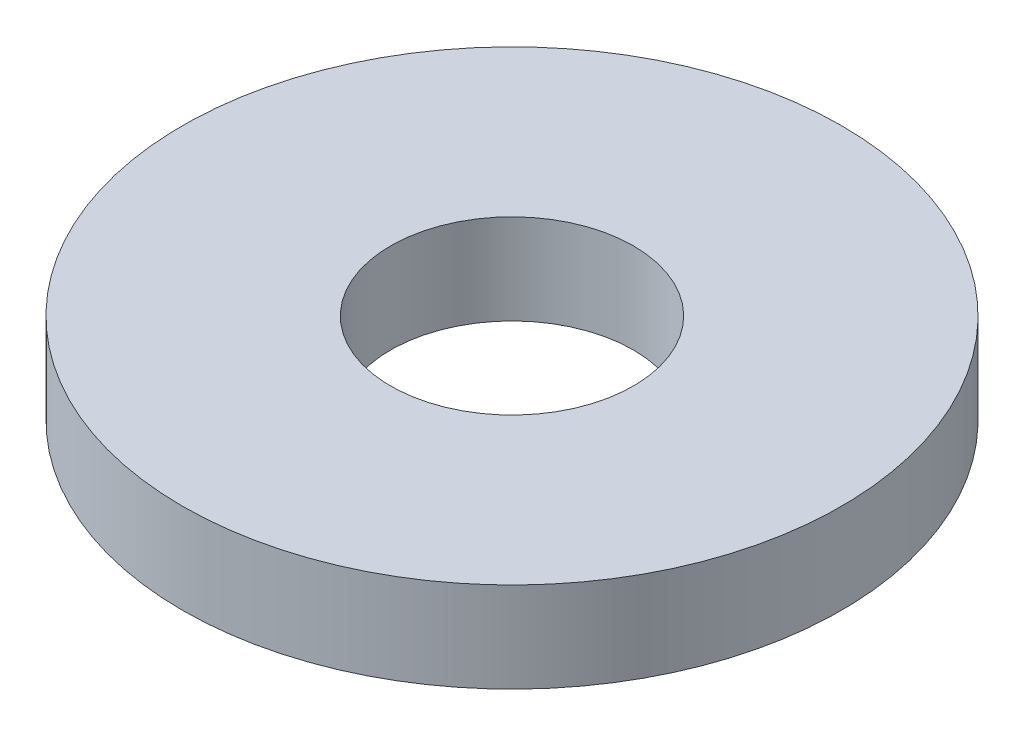
ISO-10303-21;
HEADER;
FILE_DESCRIPTION(('STEP AP214'),'2;1');
FILE_NAME('part.step','',(''),(''),'','','');
FILE_SCHEMA(('AUTOMOTIVE_DESIGN { 1 0 10303 214 1 1 1 1 }'));
ENDSEC;
DATA;
#1=APPLICATION_CONTEXT('core data for automotive mechanical design processes');
#2=APPLICATION_PROTOCOL_DEFINITION('international standard','automotive_design',2000,#1);
#3=PRODUCT_CONTEXT('',#1,'mechanical');
#4=PRODUCT('Part','Part','',(#3));
#5=PRODUCT_RELATED_PRODUCT_CATEGORY('part','',(#4));
#6=PRODUCT_DEFINITION_FORMATION('','',#4);
#7=PRODUCT_DEFINITION_CONTEXT('part definition',#1,'design');
#8=PRODUCT_DEFINITION('design','',#6,#7);
#9=PRODUCT_DEFINITION_SHAPE('','',#8);
#10=(LENGTH_UNIT() NAMED_UNIT(*) SI_UNIT(.MILLI.,.METRE.));
#11=(NAMED_UNIT(*) PLANE_ANGLE_UNIT() SI_UNIT($,.RADIAN.));
#12=(NAMED_UNIT(*) SI_UNIT($,.STERADIAN.) SOLID_ANGLE_UNIT());
#13=UNCERTAINTY_MEASURE_WITH_UNIT(LENGTH_MEASURE(1.E-05),#10,'distance_accuracy_value','');
#14=(GEOMETRIC_REPRESENTATION_CONTEXT(3) GLOBAL_UNCERTAINTY_ASSIGNED_CONTEXT((#13)) GLOBAL_UNIT_ASSIGNED_CONTEXT((#10,
#11,#12)) REPRESENTATION_CONTEXT('',''));
#15=CARTESIAN_POINT('',(0.,0.,0.));
#16=DIRECTION('',(0.,0.,1.));
#17=DIRECTION('',(1.,0.,0.));
#18=AXIS2_PLACEMENT_3D('',#15,#16,#17);
#19=CARTESIAN_POINT('',(0.,26.,0.));
#20=DIRECTION('',(0.,-1.,0.));
#21=DIRECTION('',(0.,0.,-1.));
#22=AXIS2_PLACEMENT_3D('',#19,#20,#21);
#23=CYLINDRICAL_SURFACE('',#22,95.);
#24=CARTESIAN_POINT('',(0.,26.,0.));
#25=DIRECTION('',(0.,1.,0.));
#26=DIRECTION('',(0.,0.,1.));
#27=AXIS2_PLACEMENT_3D('',#24,#25,#26);
#28=CIRCLE('',#27,95.);
#29=CARTESIAN_POINT('',(0.,26.,-95.));
#30=VERTEX_POINT('',#29);
#31=EDGE_CURVE('E10',#30,#30,#28,.T.);
#32=CARTESIAN_POINT('',(0.,0.,0.));
#33=DIRECTION('',(0.,1.,0.));
#34=DIRECTION('',(0.,0.,1.));
#35=AXIS2_PLACEMENT_3D('',#32,#33,#34);
#36=CIRCLE('',#35,95.);
#37=CARTESIAN_POINT('',(0.,0.,-95.));
#38=VERTEX_POINT('',#37);
#39=EDGE_CURVE('E37',#38,#38,#36,.T.);
#40=CARTESIAN_POINT('',(0.,26.,-95.));
#41=CARTESIAN_POINT('',(0.,25.7291666666667,-95.));
#42=CARTESIAN_POINT('',(0.,25.4583333333333,-95.));
#43=CARTESIAN_POINT('',(0.,24.9166666666667,-95.));
#44=CARTESIAN_POINT('',(0.,24.6458333333333,-95.));
#45=CARTESIAN_POINT('',(0.,24.1041666666667,-95.));
#46=CARTESIAN_POINT('',(0.,23.8333333333333,-95.));
#47=CARTESIAN_POINT('',(0.,23.2916666666667,-95.));
#48=CARTESIAN_POINT('',(0.,23.0208333333333,-95.));
#49=CARTESIAN_POINT('',(0.,22.4791666666667,-95.));
#50=CARTESIAN_POINT('',(0.,22.2083333333333,-95.));
#51=CARTESIAN_POINT('',(0.,21.6666666666667,-95.));
#52=CARTESIAN_POINT('',(0.,21.3958333333333,-95.));
#53=CARTESIAN_POINT('',(0.,20.8541666666667,-95.));
#54=CARTESIAN_POINT('',(0.,20.5833333333333,-95.));
#55=CARTESIAN_POINT('',(0.,20.0416666666667,-95.));
#56=CARTESIAN_POINT('',(0.,19.7708333333333,-95.));
#57=CARTESIAN_POINT('',(0.,19.2291666666667,-95.));
#58=CARTESIAN_POINT('',(0.,18.9583333333333,-95.));
#59=CARTESIAN_POINT('',(0.,18.4166666666667,-95.));
#60=CARTESIAN_POINT('',(0.,18.1458333333333,-95.));
#61=CARTESIAN_POINT('',(0.,17.6041666666667,-95.));
#62=CARTESIAN_POINT('',(0.,17.3333333333333,-95.));
#63=CARTESIAN_POINT('',(0.,16.7916666666667,-95.));
#64=CARTESIAN_POINT('',(0.,16.5208333333333,-95.));
#65=CARTESIAN_POINT('',(0.,15.9791666666667,-95.));
#66=CARTESIAN_POINT('',(0.,15.7083333333333,-95.));
#67=CARTESIAN_POINT('',(0.,15.1666666666667,-95.));
#68=CARTESIAN_POINT('',(0.,14.8958333333333,-95.));
#69=CARTESIAN_POINT('',(0.,14.3541666666667,-95.));
#70=CARTESIAN_POINT('',(0.,14.0833333333333,-95.));
#71=CARTESIAN_POINT('',(0.,13.5416666666667,-95.));
#72=CARTESIAN_POINT('',(0.,13.2708333333333,-95.));
#73=CARTESIAN_POINT('',(0.,12.7291666666667,-95.));
#74=CARTESIAN_POINT('',(0.,12.4583333333333,-95.));
#75=CARTESIAN_POINT('',(0.,11.9166666666667,-95.));
#76=CARTESIAN_POINT('',(0.,11.6458333333333,-95.));
#77=CARTESIAN_POINT('',(0.,11.1041666666667,-95.));
#78=CARTESIAN_POINT('',(0.,10.8333333333333,-95.));
#79=CARTESIAN_POINT('',(0.,10.2916666666667,-95.));
#80=CARTESIAN_POINT('',(0.,10.0208333333333,-95.));
#81=CARTESIAN_POINT('',(0.,9.47916666666667,-95.));
#82=CARTESIAN_POINT('',(0.,9.20833333333333,-95.));
#83=CARTESIAN_POINT('',(0.,8.66666666666667,-95.));
#84=CARTESIAN_POINT('',(0.,8.39583333333333,-95.));
#85=CARTESIAN_POINT('',(0.,7.85416666666667,-95.));
#86=CARTESIAN_POINT('',(0.,7.58333333333333,-95.));
#87=CARTESIAN_POINT('',(0.,7.04166666666667,-95.));
#88=CARTESIAN_POINT('',(0.,6.77083333333333,-95.));
#89=CARTESIAN_POINT('',(0.,6.22916666666667,-95.));
#90=CARTESIAN_POINT('',(0.,5.95833333333333,-95.));
#91=CARTESIAN_POINT('',(0.,5.41666666666667,-95.));
#92=CARTESIAN_POINT('',(0.,5.14583333333333,-95.));
#93=CARTESIAN_POINT('',(0.,4.60416666666667,-95.));
#94=CARTESIAN_POINT('',(0.,4.33333333333333,-95.));
#95=CARTESIAN_POINT('',(0.,3.79166666666667,-95.));
#96=CARTESIAN_POINT('',(0.,3.52083333333333,-95.));
#97=CARTESIAN_POINT('',(0.,2.97916666666667,-95.));
#98=CARTESIAN_POINT('',(0.,2.70833333333333,-95.));
#99=CARTESIAN_POINT('',(0.,2.16666666666667,-95.));
#100=CARTESIAN_POINT('',(0.,1.89583333333333,-95.));
#101=CARTESIAN_POINT('',(0.,1.35416666666667,-95.));
#102=CARTESIAN_POINT('',(0.,1.08333333333333,-95.));
#103=CARTESIAN_POINT('',(0.,0.541666666666667,-95.));
#104=CARTESIAN_POINT('',(0.,0.270833333333334,-95.));
#105=CARTESIAN_POINT('',(0.,0.,-95.));
#106=B_SPLINE_CURVE_WITH_KNOTS('',3,(#40,#41,#42,#43,#44,#45,#46,#47,#48,#49,#50,#51,#52,#53,
#54,#55,#56,#57,#58,#59,#60,#61,#62,#63,#64,#65,#66,#67,#68,#69,#70,#71,#72,#73,#74,#75,#76,#77,
#78,#79,#80,#81,#82,#83,#84,#85,#86,#87,#88,#89,#90,#91,#92,#93,#94,#95,#96,#97,#98,#99,#100,
#101,#102,#103,#104,#105),.UNSPECIFIED.,.F.,.F.,(4,2,2,2,2,2,2,2,2,2,2,2,2,2,2,2,2,2,2,2,2,2,2,
2,2,2,2,2,2,2,2,2,4),(0.,0.812500000000001,1.625,2.4375,3.25,4.0625,4.875,5.6875,6.5,7.3125,
8.125,8.9375,9.75,10.5625,11.375,12.1875,13.,13.8125,14.625,15.4375,16.25,17.0625,17.875,
18.6875,19.5,20.3125,21.125,21.9375,22.75,23.5625,24.375,25.1875,26.),.UNSPECIFIED.);
#107=EDGE_CURVE('BSEAM40',#30,#38,#106,.T.);
#108=ORIENTED_EDGE('',*,*,#31,.F.);
#109=ORIENTED_EDGE('',*,*,#39,.T.);
#110=ORIENTED_EDGE('',*,*,#107,.T.);
#111=ORIENTED_EDGE('',*,*,#107,.F.);
#112=EDGE_LOOP('',(#108,#110,#109,#111));
#113=FACE_BOUND('',#112,.T.);
#114=ADVANCED_FACE('F40',(#113),#23,.T.);
#115=CARTESIAN_POINT('',(0.,26.,0.));
#116=DIRECTION('',(0.,1.,0.));
#117=DIRECTION('',(0.,0.,1.));
#118=AXIS2_PLACEMENT_3D('',#115,#116,#117);
#119=PLANE('',#118);
#120=CARTESIAN_POINT('',(0.,26.,0.));
#121=DIRECTION('',(0.,1.,0.));
#122=DIRECTION('',(0.,0.,1.));
#123=AXIS2_PLACEMENT_3D('',#120,#121,#122);
#124=CIRCLE('',#123,35.);
#125=CARTESIAN_POINT('',(0.,26.,-35.));
#126=VERTEX_POINT('',#125);
#127=EDGE_CURVE('E50',#126,#126,#124,.T.);
#128=ORIENTED_EDGE('',*,*,#127,.F.);
#129=EDGE_LOOP('',(#128));
#130=FACE_BOUND('',#129,.T.);
#131=ORIENTED_EDGE('',*,*,#31,.T.);
#132=EDGE_LOOP('',(#131));
#133=FACE_BOUND('',#132,.T.);
#134=ADVANCED_FACE('F59',(#130,#133),#119,.T.);
#135=CARTESIAN_POINT('',(0.,0.,0.));
#136=DIRECTION('',(0.,1.,0.));
#137=DIRECTION('',(0.,0.,1.));
#138=AXIS2_PLACEMENT_3D('',#135,#136,#137);
#139=PLANE('',#138);
#140=CARTESIAN_POINT('',(0.,0.,0.));
#141=DIRECTION('',(0.,1.,0.));
#142=DIRECTION('',(0.,0.,1.));
#143=AXIS2_PLACEMENT_3D('',#140,#141,#142);
#144=CIRCLE('',#143,35.);
#145=CARTESIAN_POINT('',(0.,0.,-35.));
#146=VERTEX_POINT('',#145);
#147=EDGE_CURVE('E47',#146,#146,#144,.T.);
#148=ORIENTED_EDGE('',*,*,#147,.T.);
#149=EDGE_LOOP('',(#148));
#150=FACE_BOUND('',#149,.T.);
#151=ORIENTED_EDGE('',*,*,#39,.F.);
#152=EDGE_LOOP('',(#151));
#153=FACE_BOUND('',#152,.T.);
#154=ADVANCED_FACE('F58',(#150,#153),#139,.F.);
#155=CARTESIAN_POINT('',(0.,26.,0.));
#156=DIRECTION('',(0.,-1.,0.));
#157=DIRECTION('',(0.,0.,-1.));
#158=AXIS2_PLACEMENT_3D('',#155,#156,#157);
#159=CYLINDRICAL_SURFACE('',#158,35.);
#160=CARTESIAN_POINT('',(0.,26.,-35.));
#161=CARTESIAN_POINT('',(0.,25.7291666666667,-35.));
#162=CARTESIAN_POINT('',(0.,25.4583333333333,-35.));
#163=CARTESIAN_POINT('',(0.,24.9166666666667,-35.));
#164=CARTESIAN_POINT('',(0.,24.6458333333333,-35.));
#165=CARTESIAN_POINT('',(0.,24.1041666666667,-35.));
#166=CARTESIAN_POINT('',(0.,23.8333333333333,-35.));
#167=CARTESIAN_POINT('',(0.,23.2916666666667,-35.));
#168=CARTESIAN_POINT('',(0.,23.0208333333333,-35.));
#169=CARTESIAN_POINT('',(0.,22.4791666666667,-35.));
#170=CARTESIAN_POINT('',(0.,22.2083333333333,-35.));
#171=CARTESIAN_POINT('',(0.,21.6666666666667,-35.));
#172=CARTESIAN_POINT('',(0.,21.3958333333333,-35.));
#173=CARTESIAN_POINT('',(0.,20.8541666666667,-35.));
#174=CARTESIAN_POINT('',(0.,20.5833333333333,-35.));
#175=CARTESIAN_POINT('',(0.,20.0416666666667,-35.));
#176=CARTESIAN_POINT('',(0.,19.7708333333333,-35.));
#177=CARTESIAN_POINT('',(0.,19.2291666666667,-35.));
#178=CARTESIAN_POINT('',(0.,18.9583333333333,-35.));
#179=CARTESIAN_POINT('',(0.,18.4166666666667,-35.));
#180=CARTESIAN_POINT('',(0.,18.1458333333333,-35.));
#181=CARTESIAN_POINT('',(0.,17.6041666666667,-35.));
#182=CARTESIAN_POINT('',(0.,17.3333333333333,-35.));
#183=CARTESIAN_POINT('',(0.,16.7916666666667,-35.));
#184=CARTESIAN_POINT('',(0.,16.5208333333333,-35.));
#185=CARTESIAN_POINT('',(0.,15.9791666666667,-35.));
#186=CARTESIAN_POINT('',(0.,15.7083333333333,-35.));
#187=CARTESIAN_POINT('',(0.,15.1666666666667,-35.));
#188=CARTESIAN_POINT('',(0.,14.8958333333333,-35.));
#189=CARTESIAN_POINT('',(0.,14.3541666666667,-35.));
#190=CARTESIAN_POINT('',(0.,14.0833333333333,-35.));
#191=CARTESIAN_POINT('',(0.,13.5416666666667,-35.));
#192=CARTESIAN_POINT('',(0.,13.2708333333333,-35.));
#193=CARTESIAN_POINT('',(0.,12.7291666666667,-35.));
#194=CARTESIAN_POINT('',(0.,12.4583333333333,-35.));
#195=CARTESIAN_POINT('',(0.,11.9166666666667,-35.));
#196=CARTESIAN_POINT('',(0.,11.6458333333333,-35.));
#197=CARTESIAN_POINT('',(0.,11.1041666666667,-35.));
#198=CARTESIAN_POINT('',(0.,10.8333333333333,-35.));
#199=CARTESIAN_POINT('',(0.,10.2916666666667,-35.));
#200=CARTESIAN_POINT('',(0.,10.0208333333333,-35.));
#201=CARTESIAN_POINT('',(0.,9.47916666666667,-35.));
#202=CARTESIAN_POINT('',(0.,9.20833333333333,-35.));
#203=CARTESIAN_POINT('',(0.,8.66666666666667,-35.));
#204=CARTESIAN_POINT('',(0.,8.39583333333333,-35.));
#205=CARTESIAN_POINT('',(0.,7.85416666666667,-35.));
#206=CARTESIAN_POINT('',(0.,7.58333333333333,-35.));
#207=CARTESIAN_POINT('',(0.,7.04166666666667,-35.));
#208=CARTESIAN_POINT('',(0.,6.77083333333333,-35.));
#209=CARTESIAN_POINT('',(0.,6.22916666666667,-35.));
#210=CARTESIAN_POINT('',(0.,5.95833333333333,-35.));
#211=CARTESIAN_POINT('',(0.,5.41666666666667,-35.));
#212=CARTESIAN_POINT('',(0.,5.14583333333333,-35.));
#213=CARTESIAN_POINT('',(0.,4.60416666666667,-35.));
#214=CARTESIAN_POINT('',(0.,4.33333333333333,-35.));
#215=CARTESIAN_POINT('',(0.,3.79166666666667,-35.));
#216=CARTESIAN_POINT('',(0.,3.52083333333333,-35.));
#217=CARTESIAN_POINT('',(0.,2.97916666666667,-35.));
#218=CARTESIAN_POINT('',(0.,2.70833333333333,-35.));
#219=CARTESIAN_POINT('',(0.,2.16666666666667,-35.));
#220=CARTESIAN_POINT('',(0.,1.89583333333333,-35.));
#221=CARTESIAN_POINT('',(0.,1.35416666666667,-35.));
#222=CARTESIAN_POINT('',(0.,1.08333333333333,-35.));
#223=CARTESIAN_POINT('',(0.,0.541666666666667,-35.));
#224=CARTESIAN_POINT('',(0.,0.270833333333334,-35.));
#225=CARTESIAN_POINT('',(0.,0.,-35.));
#226=B_SPLINE_CURVE_WITH_KNOTS('',3,(#160,#161,#162,#163,#164,#165,#166,#167,#168,#169,#170,
#171,#172,#173,#174,#175,#176,#177,#178,#179,#180,#181,#182,#183,#184,#185,#186,#187,#188,#189,
#190,#191,#192,#193,#194,#195,#196,#197,#198,#199,#200,#201,#202,#203,#204,#205,#206,#207,#208,
#209,#210,#211,#212,#213,#214,#215,#216,#217,#218,#219,#220,#221,#222,#223,#224,#225),
.UNSPECIFIED.,.F.,.F.,(4,2,2,2,2,2,2,2,2,2,2,2,2,2,2,2,2,2,2,2,2,2,2,2,2,2,2,2,2,2,2,2,4),(0.,
0.812499999999997,1.625,2.4375,3.25,4.0625,4.875,5.6875,6.5,7.3125,8.125,8.93749999999999,
9.74999999999999,10.5625,11.375,12.1875,13.,13.8125,14.625,15.4375,16.25,17.0625,17.875,18.6875,
19.5,20.3125,21.125,21.9375,22.75,23.5625,24.375,25.1875,26.),.UNSPECIFIED.);
#227=EDGE_CURVE('BSEAM54',#126,#146,#226,.T.);
#228=ORIENTED_EDGE('',*,*,#127,.T.);
#229=ORIENTED_EDGE('',*,*,#147,.F.);
#230=ORIENTED_EDGE('',*,*,#227,.T.);
#231=ORIENTED_EDGE('',*,*,#227,.F.);
#232=EDGE_LOOP('',(#228,#230,#229,#231));
#233=FACE_BOUND('',#232,.T.);
#234=ADVANCED_FACE('F54',(#233),#159,.F.);
#235=CLOSED_SHELL('',(#114,#134,#154,#234));
#236=MANIFOLD_SOLID_BREP('B2',#235);
#237=ADVANCED_BREP_SHAPE_REPRESENTATION('',(#18,#236),#14);
#238=SHAPE_DEFINITION_REPRESENTATION(#9,#237);
ENDSEC;
END-ISO-10303-21;
